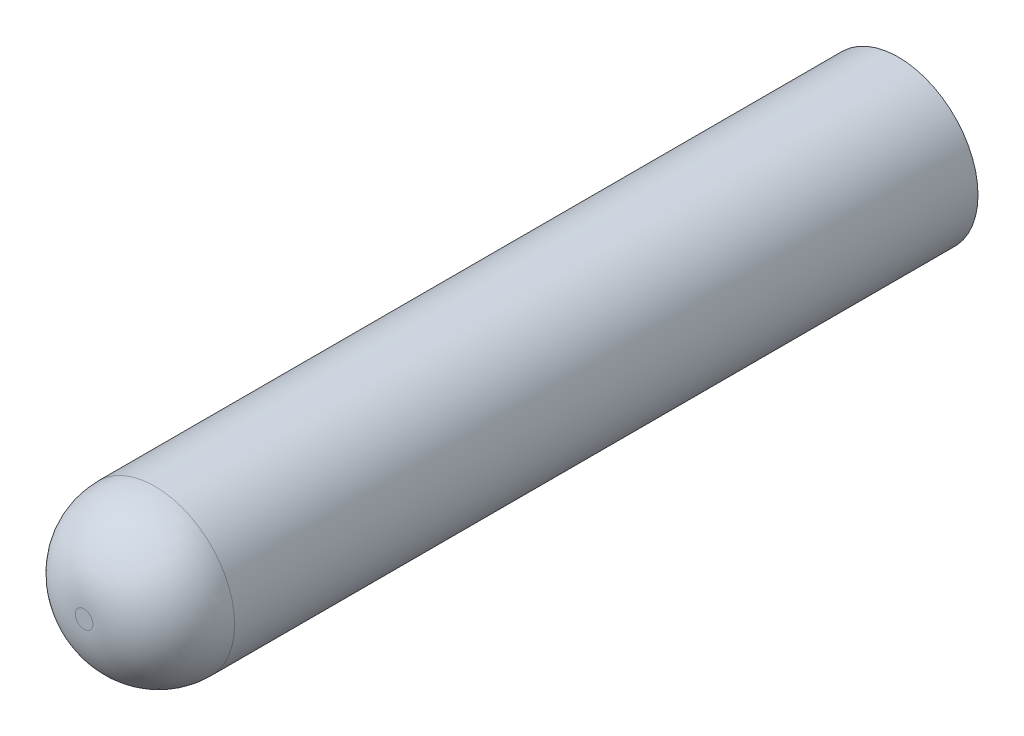
ISO-10303-21;
HEADER;
FILE_DESCRIPTION(('STEP AP214'),'2;1');
FILE_NAME('part.step','',(''),(''),'','','');
FILE_SCHEMA(('AUTOMOTIVE_DESIGN { 1 0 10303 214 1 1 1 1 }'));
ENDSEC;
DATA;
#1=APPLICATION_CONTEXT('core data for automotive mechanical design processes');
#2=APPLICATION_PROTOCOL_DEFINITION('international standard','automotive_design',2000,#1);
#3=PRODUCT_CONTEXT('',#1,'mechanical');
#4=PRODUCT('Part','Part','',(#3));
#5=PRODUCT_RELATED_PRODUCT_CATEGORY('part','',(#4));
#6=PRODUCT_DEFINITION_FORMATION('','',#4);
#7=PRODUCT_DEFINITION_CONTEXT('part definition',#1,'design');
#8=PRODUCT_DEFINITION('design','',#6,#7);
#9=PRODUCT_DEFINITION_SHAPE('','',#8);
#10=(LENGTH_UNIT() NAMED_UNIT(*) SI_UNIT(.MILLI.,.METRE.));
#11=(NAMED_UNIT(*) PLANE_ANGLE_UNIT() SI_UNIT($,.RADIAN.));
#12=(NAMED_UNIT(*) SI_UNIT($,.STERADIAN.) SOLID_ANGLE_UNIT());
#13=UNCERTAINTY_MEASURE_WITH_UNIT(LENGTH_MEASURE(1.E-05),#10,'distance_accuracy_value','');
#14=(GEOMETRIC_REPRESENTATION_CONTEXT(3) GLOBAL_UNCERTAINTY_ASSIGNED_CONTEXT((#13)) GLOBAL_UNIT_ASSIGNED_CONTEXT((#10,
#11,#12)) REPRESENTATION_CONTEXT('',''));
#15=CARTESIAN_POINT('',(0.,0.,0.));
#16=DIRECTION('',(0.,0.,1.));
#17=DIRECTION('',(1.,0.,0.));
#18=AXIS2_PLACEMENT_3D('',#15,#16,#17);
#19=CARTESIAN_POINT('',(0.,0.,23.));
#20=DIRECTION('',(0.,0.,-1.));
#21=DIRECTION('',(-1.,0.,0.));
#22=AXIS2_PLACEMENT_3D('',#19,#20,#21);
#23=CYLINDRICAL_SURFACE('',#22,2.25);
#24=CARTESIAN_POINT('',(0.,0.,21.));
#25=DIRECTION('',(0.,0.,1.));
#26=DIRECTION('',(1.,0.,0.));
#27=AXIS2_PLACEMENT_3D('',#24,#25,#26);
#28=CIRCLE('',#27,2.25);
#29=CARTESIAN_POINT('',(2.25,0.,21.));
#30=VERTEX_POINT('',#29);
#31=EDGE_CURVE('E11',#30,#30,#28,.F.);
#32=ORIENTED_EDGE('',*,*,#31,.T.);
#33=EDGE_LOOP('',(#32));
#34=FACE_BOUND('',#33,.T.);
#35=CARTESIAN_POINT('',(0.,0.,0.));
#36=DIRECTION('',(0.,0.,1.));
#37=DIRECTION('',(1.,0.,0.));
#38=AXIS2_PLACEMENT_3D('',#35,#36,#37);
#39=CIRCLE('',#38,2.25);
#40=CARTESIAN_POINT('',(2.25,0.,0.));
#41=VERTEX_POINT('',#40);
#42=EDGE_CURVE('E126',#41,#41,#39,.T.);
#43=ORIENTED_EDGE('',*,*,#42,.T.);
#44=EDGE_LOOP('',(#43));
#45=FACE_BOUND('',#44,.T.);
#46=ADVANCED_FACE('F39',(#34,#45),#23,.T.);
#47=CARTESIAN_POINT('',(0.,0.,23.));
#48=DIRECTION('',(0.,0.,1.));
#49=DIRECTION('',(1.,0.,0.));
#50=AXIS2_PLACEMENT_3D('',#47,#48,#49);
#51=PLANE('',#50);
#52=CARTESIAN_POINT('',(0.,0.,23.));
#53=DIRECTION('',(0.,0.,1.));
#54=DIRECTION('',(1.,0.,0.));
#55=AXIS2_PLACEMENT_3D('',#52,#53,#54);
#56=CIRCLE('',#55,0.25);
#57=CARTESIAN_POINT('',(0.25,0.,23.));
#58=VERTEX_POINT('',#57);
#59=EDGE_CURVE('E48',#58,#58,#56,.T.);
#60=ORIENTED_EDGE('',*,*,#59,.T.);
#61=EDGE_LOOP('',(#60));
#62=FACE_BOUND('',#61,.T.);
#63=ADVANCED_FACE('F137',(#62),#51,.T.);
#64=CARTESIAN_POINT('',(0.,0.,0.));
#65=DIRECTION('',(0.,0.,1.));
#66=DIRECTION('',(1.,0.,0.));
#67=AXIS2_PLACEMENT_3D('',#64,#65,#66);
#68=PLANE('',#67);
#69=DIRECTION('',(-1.,0.,0.));
#70=VECTOR('',#69,1.);
#71=CARTESIAN_POINT('',(0.,-1.2,0.));
#72=LINE('',#71,#70);
#73=CARTESIAN_POINT('',(1.2,-1.2,0.));
#74=VERTEX_POINT('',#73);
#75=CARTESIAN_POINT('',(-1.2,-1.2,0.));
#76=VERTEX_POINT('',#75);
#77=EDGE_CURVE('E90',#74,#76,#72,.T.);
#78=ORIENTED_EDGE('',*,*,#77,.F.);
#79=DIRECTION('',(0.,-1.,0.));
#80=VECTOR('',#79,1.);
#81=CARTESIAN_POINT('',(1.2,0.,0.));
#82=LINE('',#81,#80);
#83=CARTESIAN_POINT('',(1.2,1.2,0.));
#84=VERTEX_POINT('',#83);
#85=EDGE_CURVE('E55',#84,#74,#82,.T.);
#86=ORIENTED_EDGE('',*,*,#85,.F.);
#87=DIRECTION('',(1.,0.,0.));
#88=VECTOR('',#87,1.);
#89=CARTESIAN_POINT('',(0.,1.2,0.));
#90=LINE('',#89,#88);
#91=CARTESIAN_POINT('',(-1.2,1.2,0.));
#92=VERTEX_POINT('',#91);
#93=EDGE_CURVE('E110',#92,#84,#90,.T.);
#94=ORIENTED_EDGE('',*,*,#93,.F.);
#95=DIRECTION('',(0.,1.,0.));
#96=VECTOR('',#95,1.);
#97=CARTESIAN_POINT('',(-1.2,0.,0.));
#98=LINE('',#97,#96);
#99=EDGE_CURVE('E119',#76,#92,#98,.T.);
#100=ORIENTED_EDGE('',*,*,#99,.F.);
#101=EDGE_LOOP('',(#78,#86,#94,#100));
#102=FACE_BOUND('',#101,.T.);
#103=ORIENTED_EDGE('',*,*,#42,.F.);
#104=EDGE_LOOP('',(#103));
#105=FACE_BOUND('',#104,.T.);
#106=ADVANCED_FACE('F151',(#102,#105),#68,.F.);
#107=CARTESIAN_POINT('',(1.2,0.,4.5));
#108=DIRECTION('',(1.,0.,0.));
#109=DIRECTION('',(0.,0.,-1.));
#110=AXIS2_PLACEMENT_3D('',#107,#108,#109);
#111=PLANE('',#110);
#112=ORIENTED_EDGE('',*,*,#85,.T.);
#113=DIRECTION('',(0.,0.,-1.));
#114=VECTOR('',#113,1.);
#115=CARTESIAN_POINT('',(1.2,-1.2,4.5));
#116=LINE('',#115,#114);
#117=CARTESIAN_POINT('',(1.2,-1.2,4.5));
#118=VERTEX_POINT('',#117);
#119=EDGE_CURVE('E78',#118,#74,#116,.T.);
#120=ORIENTED_EDGE('',*,*,#119,.F.);
#121=DIRECTION('',(0.,-1.,0.));
#122=VECTOR('',#121,1.);
#123=CARTESIAN_POINT('',(1.2,0.,4.5));
#124=LINE('',#123,#122);
#125=CARTESIAN_POINT('',(1.2,1.2,4.5));
#126=VERTEX_POINT('',#125);
#127=EDGE_CURVE('E106',#126,#118,#124,.T.);
#128=ORIENTED_EDGE('',*,*,#127,.F.);
#129=DIRECTION('',(0.,0.,-1.));
#130=VECTOR('',#129,1.);
#131=CARTESIAN_POINT('',(1.2,1.2,4.5));
#132=LINE('',#131,#130);
#133=EDGE_CURVE('E63',#126,#84,#132,.T.);
#134=ORIENTED_EDGE('',*,*,#133,.T.);
#135=EDGE_LOOP('',(#112,#120,#128,#134));
#136=FACE_BOUND('',#135,.T.);
#137=ADVANCED_FACE('F156',(#136),#111,.F.);
#138=CARTESIAN_POINT('',(0.,1.2,4.5));
#139=DIRECTION('',(0.,1.,0.));
#140=DIRECTION('',(-1.,0.,0.));
#141=AXIS2_PLACEMENT_3D('',#138,#139,#140);
#142=PLANE('',#141);
#143=ORIENTED_EDGE('',*,*,#93,.T.);
#144=ORIENTED_EDGE('',*,*,#133,.F.);
#145=DIRECTION('',(1.,0.,0.));
#146=VECTOR('',#145,1.);
#147=CARTESIAN_POINT('',(0.,1.2,4.5));
#148=LINE('',#147,#146);
#149=CARTESIAN_POINT('',(-1.2,1.2,4.5));
#150=VERTEX_POINT('',#149);
#151=EDGE_CURVE('E103',#150,#126,#148,.T.);
#152=ORIENTED_EDGE('',*,*,#151,.F.);
#153=DIRECTION('',(0.,0.,-1.));
#154=VECTOR('',#153,1.);
#155=CARTESIAN_POINT('',(-1.2,1.2,4.5));
#156=LINE('',#155,#154);
#157=EDGE_CURVE('E95',#150,#92,#156,.T.);
#158=ORIENTED_EDGE('',*,*,#157,.T.);
#159=EDGE_LOOP('',(#143,#144,#152,#158));
#160=FACE_BOUND('',#159,.T.);
#161=ADVANCED_FACE('F161',(#160),#142,.F.);
#162=CARTESIAN_POINT('',(-1.2,0.,4.5));
#163=DIRECTION('',(-1.,0.,0.));
#164=DIRECTION('',(0.,0.,1.));
#165=AXIS2_PLACEMENT_3D('',#162,#163,#164);
#166=PLANE('',#165);
#167=ORIENTED_EDGE('',*,*,#99,.T.);
#168=ORIENTED_EDGE('',*,*,#157,.F.);
#169=DIRECTION('',(0.,1.,0.));
#170=VECTOR('',#169,1.);
#171=CARTESIAN_POINT('',(-1.2,0.,4.5));
#172=LINE('',#171,#170);
#173=CARTESIAN_POINT('',(-1.2,-1.2,4.5));
#174=VERTEX_POINT('',#173);
#175=EDGE_CURVE('E98',#174,#150,#172,.T.);
#176=ORIENTED_EDGE('',*,*,#175,.F.);
#177=DIRECTION('',(0.,0.,-1.));
#178=VECTOR('',#177,1.);
#179=CARTESIAN_POINT('',(-1.2,-1.2,4.5));
#180=LINE('',#179,#178);
#181=EDGE_CURVE('E83',#174,#76,#180,.T.);
#182=ORIENTED_EDGE('',*,*,#181,.T.);
#183=EDGE_LOOP('',(#167,#168,#176,#182));
#184=FACE_BOUND('',#183,.T.);
#185=ADVANCED_FACE('F99',(#184),#166,.F.);
#186=CARTESIAN_POINT('',(0.,-1.2,4.5));
#187=DIRECTION('',(0.,-1.,0.));
#188=DIRECTION('',(1.,0.,0.));
#189=AXIS2_PLACEMENT_3D('',#186,#187,#188);
#190=PLANE('',#189);
#191=ORIENTED_EDGE('',*,*,#77,.T.);
#192=ORIENTED_EDGE('',*,*,#181,.F.);
#193=DIRECTION('',(-1.,0.,0.));
#194=VECTOR('',#193,1.);
#195=CARTESIAN_POINT('',(0.,-1.2,4.5));
#196=LINE('',#195,#194);
#197=EDGE_CURVE('E87',#118,#174,#196,.T.);
#198=ORIENTED_EDGE('',*,*,#197,.F.);
#199=ORIENTED_EDGE('',*,*,#119,.T.);
#200=EDGE_LOOP('',(#191,#192,#198,#199));
#201=FACE_BOUND('',#200,.T.);
#202=ADVANCED_FACE('F85',(#201),#190,.F.);
#203=CARTESIAN_POINT('',(0.,0.,4.5));
#204=DIRECTION('',(0.,0.,-1.));
#205=DIRECTION('',(-1.,0.,0.));
#206=AXIS2_PLACEMENT_3D('',#203,#204,#205);
#207=PLANE('',#206);
#208=ORIENTED_EDGE('',*,*,#127,.T.);
#209=ORIENTED_EDGE('',*,*,#197,.T.);
#210=ORIENTED_EDGE('',*,*,#175,.T.);
#211=ORIENTED_EDGE('',*,*,#151,.T.);
#212=EDGE_LOOP('',(#208,#209,#210,#211));
#213=FACE_BOUND('',#212,.T.);
#214=ADVANCED_FACE('F105',(#213),#207,.T.);
#215=CARTESIAN_POINT('',(0.,0.,21.));
#216=DIRECTION('',(0.,0.,1.));
#217=DIRECTION('',(1.,0.,0.));
#218=AXIS2_PLACEMENT_3D('',#215,#216,#217);
#219=DEGENERATE_TOROIDAL_SURFACE('',#218,0.25,2.,.T.);
#220=ORIENTED_EDGE('',*,*,#31,.F.);
#221=EDGE_LOOP('',(#220));
#222=FACE_BOUND('',#221,.T.);
#223=ORIENTED_EDGE('',*,*,#59,.F.);
#224=EDGE_LOOP('',(#223));
#225=FACE_BOUND('',#224,.T.);
#226=ADVANCED_FACE('F41',(#222,#225),#219,.T.);
#227=CLOSED_SHELL('',(#46,#63,#106,#137,#161,#185,#202,#214,#226));
#228=MANIFOLD_SOLID_BREP('B2',#227);
#229=ADVANCED_BREP_SHAPE_REPRESENTATION('',(#18,#228),#14);
#230=SHAPE_DEFINITION_REPRESENTATION(#9,#229);
ENDSEC;
END-ISO-10303-21;
